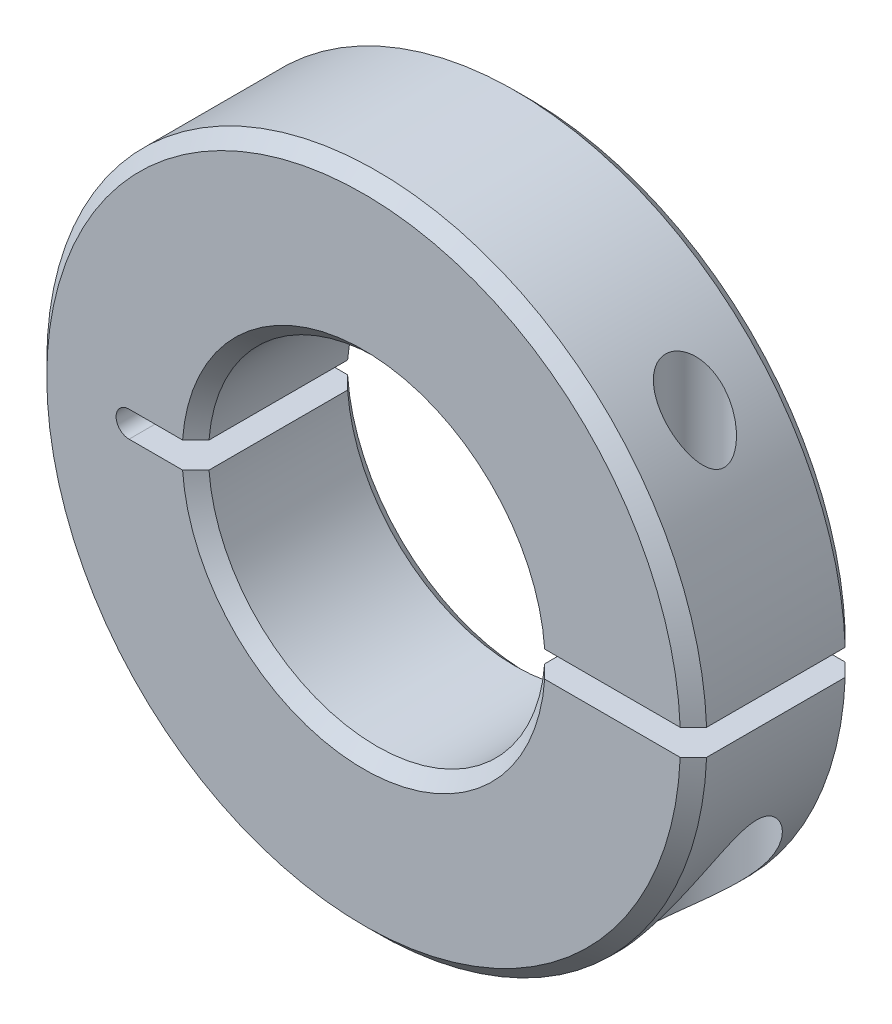
ISO-10303-21;
HEADER;
FILE_DESCRIPTION(('STEP AP214'),'2;1');
FILE_NAME('part.step','',(''),(''),'','','');
FILE_SCHEMA(('AUTOMOTIVE_DESIGN { 1 0 10303 214 1 1 1 1 }'));
ENDSEC;
DATA;
#1=APPLICATION_CONTEXT('core data for automotive mechanical design processes');
#2=APPLICATION_PROTOCOL_DEFINITION('international standard','automotive_design',2000,#1);
#3=PRODUCT_CONTEXT('',#1,'mechanical');
#4=PRODUCT('Part','Part','',(#3));
#5=PRODUCT_RELATED_PRODUCT_CATEGORY('part','',(#4));
#6=PRODUCT_DEFINITION_FORMATION('','',#4);
#7=PRODUCT_DEFINITION_CONTEXT('part definition',#1,'design');
#8=PRODUCT_DEFINITION('design','',#6,#7);
#9=PRODUCT_DEFINITION_SHAPE('','',#8);
#10=(LENGTH_UNIT() NAMED_UNIT(*) SI_UNIT(.MILLI.,.METRE.));
#11=(NAMED_UNIT(*) PLANE_ANGLE_UNIT() SI_UNIT($,.RADIAN.));
#12=(NAMED_UNIT(*) SI_UNIT($,.STERADIAN.) SOLID_ANGLE_UNIT());
#13=UNCERTAINTY_MEASURE_WITH_UNIT(LENGTH_MEASURE(1.E-05),#10,'distance_accuracy_value','');
#14=(GEOMETRIC_REPRESENTATION_CONTEXT(3) GLOBAL_UNCERTAINTY_ASSIGNED_CONTEXT((#13)) GLOBAL_UNIT_ASSIGNED_CONTEXT((#10,
#11,#12)) REPRESENTATION_CONTEXT('',''));
#15=CARTESIAN_POINT('',(0.,0.,0.));
#16=DIRECTION('',(0.,0.,1.));
#17=DIRECTION('',(1.,0.,0.));
#18=AXIS2_PLACEMENT_3D('',#15,#16,#17);
#19=CARTESIAN_POINT('',(-13.5403707337033,2.61561229831386,-2.57291950947665));
#20=DIRECTION('',(0.,0.,-1.));
#21=DIRECTION('',(-1.,0.,0.));
#22=AXIS2_PLACEMENT_3D('',#19,#20,#21);
#23=CYLINDRICAL_SURFACE('',#22,0.5);
#24=CARTESIAN_POINT('',(-13.5403707337033,2.61561229831386,-2.57291950947665));
#25=DIRECTION('',(0.,0.,-1.));
#26=DIRECTION('',(-1.,0.,0.));
#27=AXIS2_PLACEMENT_3D('',#24,#25,#26);
#28=CIRCLE('',#27,0.5);
#29=CARTESIAN_POINT('',(-13.5403707337033,3.11561229831386,-2.57291950947665));
#30=VERTEX_POINT('',#29);
#31=CARTESIAN_POINT('',(-13.5403707337033,2.11561229831386,-2.57291950947665));
#32=VERTEX_POINT('',#31);
#33=EDGE_CURVE('E128',#30,#32,#28,.F.);
#34=ORIENTED_EDGE('',*,*,#33,.F.);
#35=DIRECTION('',(0.,0.,1.));
#36=VECTOR('',#35,1.);
#37=CARTESIAN_POINT('',(-13.5403707337033,3.11561229831386,3.77708049052335));
#38=LINE('',#37,#36);
#39=CARTESIAN_POINT('',(-13.5403707337033,3.11561229831386,3.77708049052335));
#40=VERTEX_POINT('',#39);
#41=EDGE_CURVE('E130',#30,#40,#38,.T.);
#42=ORIENTED_EDGE('',*,*,#41,.T.);
#43=CARTESIAN_POINT('',(-13.5403707337033,2.61561229831386,3.77708049052335));
#44=DIRECTION('',(0.,0.,-1.));
#45=DIRECTION('',(-1.,0.,0.));
#46=AXIS2_PLACEMENT_3D('',#43,#44,#45);
#47=CIRCLE('',#46,0.5);
#48=CARTESIAN_POINT('',(-13.5403707337033,2.11561229831386,3.77708049052335));
#49=VERTEX_POINT('',#48);
#50=EDGE_CURVE('E20',#49,#40,#47,.T.);
#51=ORIENTED_EDGE('',*,*,#50,.F.);
#52=DIRECTION('',(0.,0.,-1.));
#53=VECTOR('',#52,1.);
#54=CARTESIAN_POINT('',(-13.5403707337033,2.11561229831386,3.77708049052335));
#55=LINE('',#54,#53);
#56=EDGE_CURVE('E161',#49,#32,#55,.T.);
#57=ORIENTED_EDGE('',*,*,#56,.T.);
#58=EDGE_LOOP('',(#34,#42,#51,#57));
#59=FACE_BOUND('',#58,.T.);
#60=ADVANCED_FACE('F17',(#59),#23,.F.);
#61=CARTESIAN_POINT('',(-4.51537073370329,2.61561229831386,3.77708049040848));
#62=DIRECTION('',(0.,0.,1.));
#63=DIRECTION('',(0.,-1.,0.));
#64=AXIS2_PLACEMENT_3D('',#61,#62,#63);
#65=CONICAL_SURFACE('',#64,6.98499999997577,0.785398163397448);
#66=CARTESIAN_POINT('',(-4.51537073370329,2.61561229831386,3.77708049052217));
#67=DIRECTION('',(0.,0.,1.));
#68=DIRECTION('',(0.,-1.,0.));
#69=AXIS2_PLACEMENT_3D('',#66,#67,#68);
#70=CIRCLE('',#69,6.98500000008945);
#71=CARTESIAN_POINT('',(2.4517107931001,2.11561229831386,3.77708049051325));
#72=VERTEX_POINT('',#71);
#73=CARTESIAN_POINT('',(-11.4824522604978,2.11561229831386,3.77708049050444));
#74=VERTEX_POINT('',#73);
#75=EDGE_CURVE('E143',#72,#74,#70,.F.);
#76=ORIENTED_EDGE('',*,*,#75,.F.);
#77=CARTESIAN_POINT('',(1.94230137009464,2.11561229832615,3.26908049046226));
#78=CARTESIAN_POINT('',(2.02721181716358,2.11561229832,3.35373825595638));
#79=CARTESIAN_POINT('',(2.11211782595216,2.11561229831591,3.43840047204468));
#80=CARTESIAN_POINT('',(2.281920966951,2.11561229831181,3.60773380539203));
#81=CARTESIAN_POINT('',(2.36681809916126,2.11561229831181,3.6924049226511));
#82=CARTESIAN_POINT('',(2.45171079309116,2.11561229831386,3.77708049050433));
#83=B_SPLINE_CURVE_WITH_KNOTS('',3,(#77,#78,#79,#80,#81,#82),.UNSPECIFIED.,.F.,.F.,(4,2,4),(0.,
0.359708896821428,0.719417793568256),.UNSPECIFIED.);
#84=CARTESIAN_POINT('',(1.94230137009217,2.11561229831386,3.26908049048868));
#85=VERTEX_POINT('',#84);
#86=EDGE_CURVE('E330',#85,#72,#83,.T.);
#87=ORIENTED_EDGE('',*,*,#86,.F.);
#88=CARTESIAN_POINT('',(-4.51537073370329,2.61561229831386,3.26908049052333));
#89=DIRECTION('',(0.,0.,1.));
#90=DIRECTION('',(1.,0.,0.));
#91=AXIS2_PLACEMENT_3D('',#88,#89,#90);
#92=CIRCLE('',#91,6.477);
#93=CARTESIAN_POINT('',(-10.9730428375081,2.11561229831386,3.26908049049802));
#94=VERTEX_POINT('',#93);
#95=EDGE_CURVE('E177',#85,#94,#92,.F.);
#96=ORIENTED_EDGE('',*,*,#95,.T.);
#97=CARTESIAN_POINT('',(-10.9730428375282,2.11561229831386,3.26908049047271));
#98=CARTESIAN_POINT('',(-11.0579532845869,2.11561229831386,3.3537382559649));
#99=CARTESIAN_POINT('',(-11.1428592933667,2.11561229831386,3.43840047204989));
#100=CARTESIAN_POINT('',(-11.3126624343507,2.11561229831386,3.60773380538789));
#101=CARTESIAN_POINT('',(-11.3975595665549,2.11561229831386,3.6924049226409));
#102=CARTESIAN_POINT('',(-11.4824522604801,2.11561229831386,3.7770804904867));
#103=B_SPLINE_CURVE_WITH_KNOTS('',3,(#97,#98,#99,#100,#101,#102),.UNSPECIFIED.,.F.,.F.,(4,2,4),
(0.,0.359708896795713,0.719417793516825),.UNSPECIFIED.);
#104=EDGE_CURVE('E134',#94,#74,#103,.T.);
#105=ORIENTED_EDGE('',*,*,#104,.T.);
#106=EDGE_LOOP('',(#76,#87,#96,#105));
#107=FACE_BOUND('',#106,.T.);
#108=ADVANCED_FACE('F318',(#107),#65,.F.);
#109=CARTESIAN_POINT('',(-4.51537073370329,2.61561229831386,3.77708049040848));
#110=DIRECTION('',(0.,0.,1.));
#111=DIRECTION('',(0.,-1.,0.));
#112=AXIS2_PLACEMENT_3D('',#109,#110,#111);
#113=CONICAL_SURFACE('',#112,6.98499999997577,0.785398163397448);
#114=CARTESIAN_POINT('',(-4.51537073370329,2.61561229831386,3.77708049052217));
#115=DIRECTION('',(0.,0.,1.));
#116=DIRECTION('',(0.,-1.,0.));
#117=AXIS2_PLACEMENT_3D('',#114,#115,#116);
#118=CIRCLE('',#117,6.98500000008945);
#119=CARTESIAN_POINT('',(-11.4824522604978,3.11561229831386,3.77708049050444));
#120=VERTEX_POINT('',#119);
#121=CARTESIAN_POINT('',(2.4517107931001,3.11561229831386,3.77708049051325));
#122=VERTEX_POINT('',#121);
#123=EDGE_CURVE('E139',#120,#122,#118,.F.);
#124=ORIENTED_EDGE('',*,*,#123,.F.);
#125=CARTESIAN_POINT('',(-11.4824522604801,3.11561229831386,3.7770804904867));
#126=CARTESIAN_POINT('',(-11.3975595665553,3.11561229831386,3.69240492264133));
#127=CARTESIAN_POINT('',(-11.3126624343515,3.11561229831386,3.60773380538875));
#128=CARTESIAN_POINT('',(-11.1428592933684,3.11561229831386,3.43840047205161));
#129=CARTESIAN_POINT('',(-11.0579532845891,3.11561229831386,3.35373825596705));
#130=CARTESIAN_POINT('',(-10.9730428375308,3.11561229831386,3.26908049047529));
#131=B_SPLINE_CURVE_WITH_KNOTS('',3,(#125,#126,#127,#128,#129,#130),.UNSPECIFIED.,.F.,.F.,(4,2,
4),(0.,0.359708896719285,0.71941779351317),.UNSPECIFIED.);
#132=CARTESIAN_POINT('',(-10.9730428375094,3.11561229831386,3.26908049049931));
#133=VERTEX_POINT('',#132);
#134=EDGE_CURVE('E133',#120,#133,#131,.T.);
#135=ORIENTED_EDGE('',*,*,#134,.T.);
#136=CARTESIAN_POINT('',(-4.51537073370329,2.61561229831386,3.26908049052333));
#137=DIRECTION('',(0.,0.,1.));
#138=DIRECTION('',(1.,0.,0.));
#139=AXIS2_PLACEMENT_3D('',#136,#137,#138);
#140=CIRCLE('',#139,6.477);
#141=CARTESIAN_POINT('',(1.94230137009217,3.11561229831386,3.26908049048868));
#142=VERTEX_POINT('',#141);
#143=EDGE_CURVE('E173',#133,#142,#140,.F.);
#144=ORIENTED_EDGE('',*,*,#143,.T.);
#145=CARTESIAN_POINT('',(2.4517107930834,3.11561229830229,3.77708049051212));
#146=CARTESIAN_POINT('',(2.36681809915601,3.11561229830808,3.69240492265637));
#147=CARTESIAN_POINT('',(2.28192096694834,3.11561229831193,3.60773380539471));
#148=CARTESIAN_POINT('',(2.11211782595483,3.11561229831579,3.43840047204201));
#149=CARTESIAN_POINT('',(2.02721181716898,3.11561229831579,3.35373825595097));
#150=CARTESIAN_POINT('',(1.94230137010285,3.11561229831386,3.26908049045402));
#151=B_SPLINE_CURVE_WITH_KNOTS('',3,(#145,#146,#147,#148,#149,#150),.UNSPECIFIED.,.F.,.F.,(4,2,
4),(0.,0.359708896746828,0.719417793568255),.UNSPECIFIED.);
#152=EDGE_CURVE('E324',#122,#142,#151,.T.);
#153=ORIENTED_EDGE('',*,*,#152,.F.);
#154=EDGE_LOOP('',(#124,#135,#144,#153));
#155=FACE_BOUND('',#154,.T.);
#156=ADVANCED_FACE('F314',(#155),#113,.F.);
#157=CARTESIAN_POINT('',(-4.51537073370329,2.61561229831386,-2.57291950947547));
#158=DIRECTION('',(0.,0.,-1.));
#159=DIRECTION('',(-1.,0.,0.));
#160=AXIS2_PLACEMENT_3D('',#157,#158,#159);
#161=CONICAL_SURFACE('',#160,6.98499999999629,0.785398163453397);
#162=CARTESIAN_POINT('',(-4.51537073370329,2.61561229831386,-2.06491950947665));
#163=DIRECTION('',(0.,0.,1.));
#164=DIRECTION('',(1.,0.,0.));
#165=AXIS2_PLACEMENT_3D('',#162,#163,#164);
#166=CIRCLE('',#165,6.477);
#167=CARTESIAN_POINT('',(-10.9730428374742,2.11561229831386,-2.06491950949249));
#168=VERTEX_POINT('',#167);
#169=CARTESIAN_POINT('',(1.94230137006789,2.11561229831386,-2.06491950949279));
#170=VERTEX_POINT('',#169);
#171=EDGE_CURVE('E176',#168,#170,#166,.T.);
#172=ORIENTED_EDGE('',*,*,#171,.T.);
#173=CARTESIAN_POINT('',(2.45171079301663,2.11561229831386,-2.57291950947645));
#174=CARTESIAN_POINT('',(2.36681809908969,2.11561229831386,-2.48824394163839));
#175=CARTESIAN_POINT('',(2.28192096688376,2.11561229831386,-2.40357282439312));
#176=CARTESIAN_POINT('',(2.11211782589632,2.11561229831386,-2.23423949107061));
#177=CARTESIAN_POINT('',(2.0272118171148,2.11561229831386,-2.14957727499337));
#178=CARTESIAN_POINT('',(1.9423013700543,2.11561229831386,-2.06491950950892));
#179=B_SPLINE_CURVE_WITH_KNOTS('',3,(#173,#174,#175,#176,#177,#178),.UNSPECIFIED.,.F.,.F.,(4,2,
4),(0.,0.359708896708405,0.71941779349141),.UNSPECIFIED.);
#180=CARTESIAN_POINT('',(2.45171079301614,2.11561229831386,-2.57291950947596));
#181=VERTEX_POINT('',#180);
#182=EDGE_CURVE('E164',#181,#170,#179,.T.);
#183=ORIENTED_EDGE('',*,*,#182,.F.);
#184=CARTESIAN_POINT('',(-4.51537073370329,2.61561229831386,-2.57291950947547));
#185=DIRECTION('',(0.,0.,-1.));
#186=DIRECTION('',(-1.,0.,0.));
#187=AXIS2_PLACEMENT_3D('',#184,#185,#186);
#188=CIRCLE('',#187,6.98499999999629);
#189=CARTESIAN_POINT('',(-11.4824522604232,2.11561229831386,-2.57291950947644));
#190=VERTEX_POINT('',#189);
#191=EDGE_CURVE('E141',#181,#190,#188,.T.);
#192=ORIENTED_EDGE('',*,*,#191,.T.);
#193=CARTESIAN_POINT('',(-11.4824522604242,2.11561229831386,-2.57291950947741));
#194=CARTESIAN_POINT('',(-11.397559566497,2.11561229831386,-2.48824394163909));
#195=CARTESIAN_POINT('',(-11.3126624342908,2.11561229831386,-2.40357282439357));
#196=CARTESIAN_POINT('',(-11.1428592933028,2.11561229831386,-2.23423949107054));
#197=CARTESIAN_POINT('',(-11.0579532845211,2.11561229831386,-2.14957727499304));
#198=CARTESIAN_POINT('',(-10.9730428374603,2.11561229831386,-2.06491950950833));
#199=B_SPLINE_CURVE_WITH_KNOTS('',3,(#193,#194,#195,#196,#197,#198),.UNSPECIFIED.,.F.,.F.,(4,2,
4),(0.,0.359708896709502,0.719417793493605),.UNSPECIFIED.);
#200=EDGE_CURVE('E163',#190,#168,#199,.T.);
#201=ORIENTED_EDGE('',*,*,#200,.T.);
#202=EDGE_LOOP('',(#172,#183,#192,#201));
#203=FACE_BOUND('',#202,.T.);
#204=ADVANCED_FACE('F317',(#203),#161,.F.);
#205=CARTESIAN_POINT('',(-14.0403707337033,2.11561229831386,3.77708049052335));
#206=DIRECTION('',(0.,-1.,0.));
#207=DIRECTION('',(0.,0.,-1.));
#208=AXIS2_PLACEMENT_3D('',#205,#206,#207);
#209=PLANE('',#208);
#210=ORIENTED_EDGE('',*,*,#104,.F.);
#211=DIRECTION('',(0.,0.,1.));
#212=VECTOR('',#211,1.);
#213=CARTESIAN_POINT('',(-10.9730428374881,2.11561229831386,3.77708049052335));
#214=LINE('',#213,#212);
#215=EDGE_CURVE('E179',#94,#168,#214,.F.);
#216=ORIENTED_EDGE('',*,*,#215,.T.);
#217=ORIENTED_EDGE('',*,*,#200,.F.);
#218=DIRECTION('',(1.,0.,0.));
#219=VECTOR('',#218,1.);
#220=CARTESIAN_POINT('',(-4.51537073370329,2.11561229831386,-2.57291950947665));
#221=LINE('',#220,#219);
#222=EDGE_CURVE('E276',#190,#32,#221,.F.);
#223=ORIENTED_EDGE('',*,*,#222,.T.);
#224=ORIENTED_EDGE('',*,*,#56,.F.);
#225=DIRECTION('',(1.,0.,0.));
#226=VECTOR('',#225,1.);
#227=CARTESIAN_POINT('',(-4.51537073370329,2.11561229831386,3.77708049052335));
#228=LINE('',#227,#226);
#229=EDGE_CURVE('E127',#74,#49,#228,.F.);
#230=ORIENTED_EDGE('',*,*,#229,.F.);
#231=EDGE_LOOP('',(#210,#216,#217,#223,#224,#230));
#232=FACE_BOUND('',#231,.T.);
#233=ADVANCED_FACE('F301',(#232),#209,.F.);
#234=CARTESIAN_POINT('',(-14.0403707337033,3.11561229831386,3.77708049052335));
#235=DIRECTION('',(0.,1.,0.));
#236=DIRECTION('',(0.,0.,1.));
#237=AXIS2_PLACEMENT_3D('',#234,#235,#236);
#238=PLANE('',#237);
#239=ORIENTED_EDGE('',*,*,#134,.F.);
#240=DIRECTION('',(1.,0.,0.));
#241=VECTOR('',#240,1.);
#242=CARTESIAN_POINT('',(-4.51537073370329,3.11561229831386,3.77708049052335));
#243=LINE('',#242,#241);
#244=EDGE_CURVE('E124',#40,#120,#243,.T.);
#245=ORIENTED_EDGE('',*,*,#244,.F.);
#246=ORIENTED_EDGE('',*,*,#41,.F.);
#247=DIRECTION('',(1.,0.,0.));
#248=VECTOR('',#247,1.);
#249=CARTESIAN_POINT('',(-4.51537073370329,3.11561229831386,-2.57291950947665));
#250=LINE('',#249,#248);
#251=CARTESIAN_POINT('',(-11.4824522604228,3.11561229831386,-2.57291950947606));
#252=VERTEX_POINT('',#251);
#253=EDGE_CURVE('E275',#30,#252,#250,.T.);
#254=ORIENTED_EDGE('',*,*,#253,.T.);
#255=CARTESIAN_POINT('',(-11.4824522604232,3.11561229831386,-2.57291950947645));
#256=CARTESIAN_POINT('',(-11.3975595664963,3.11561229831386,-2.48824394163839));
#257=CARTESIAN_POINT('',(-11.3126624342903,3.11561229831386,-2.40357282439312));
#258=CARTESIAN_POINT('',(-11.1428592933029,3.11561229831386,-2.23423949107061));
#259=CARTESIAN_POINT('',(-11.0579532845214,3.11561229831386,-2.14957727499337));
#260=CARTESIAN_POINT('',(-10.9730428374609,3.11561229831386,-2.06491950950892));
#261=B_SPLINE_CURVE_WITH_KNOTS('',3,(#255,#256,#257,#258,#259,#260),.UNSPECIFIED.,.F.,.F.,(4,2,
4),(0.,0.359708896708398,0.719417793491398),.UNSPECIFIED.);
#262=CARTESIAN_POINT('',(-10.9730428374745,3.11561229831386,-2.06491950949279));
#263=VERTEX_POINT('',#262);
#264=EDGE_CURVE('E284',#252,#263,#261,.T.);
#265=ORIENTED_EDGE('',*,*,#264,.T.);
#266=DIRECTION('',(0.,0.,1.));
#267=VECTOR('',#266,1.);
#268=CARTESIAN_POINT('',(-10.9730428374881,3.11561229831386,3.77708049052335));
#269=LINE('',#268,#267);
#270=EDGE_CURVE('E168',#263,#133,#269,.T.);
#271=ORIENTED_EDGE('',*,*,#270,.T.);
#272=EDGE_LOOP('',(#239,#245,#246,#254,#265,#271));
#273=FACE_BOUND('',#272,.T.);
#274=ADVANCED_FACE('F136',(#273),#238,.F.);
#275=CARTESIAN_POINT('',(-4.51537073370329,2.61561229831386,-2.57291950947547));
#276=DIRECTION('',(0.,0.,-1.));
#277=DIRECTION('',(-1.,0.,0.));
#278=AXIS2_PLACEMENT_3D('',#275,#276,#277);
#279=CONICAL_SURFACE('',#278,6.98499999999629,0.785398163453397);
#280=CARTESIAN_POINT('',(-4.51537073370329,2.61561229831386,-2.06491950947665));
#281=DIRECTION('',(0.,0.,1.));
#282=DIRECTION('',(1.,0.,0.));
#283=AXIS2_PLACEMENT_3D('',#280,#281,#282);
#284=CIRCLE('',#283,6.477);
#285=CARTESIAN_POINT('',(1.94230137006789,3.11561229831386,-2.06491950949279));
#286=VERTEX_POINT('',#285);
#287=EDGE_CURVE('E165',#286,#263,#284,.T.);
#288=ORIENTED_EDGE('',*,*,#287,.T.);
#289=ORIENTED_EDGE('',*,*,#264,.F.);
#290=CARTESIAN_POINT('',(-4.51537073370329,2.61561229831386,-2.57291950947547));
#291=DIRECTION('',(0.,0.,-1.));
#292=DIRECTION('',(-1.,0.,0.));
#293=AXIS2_PLACEMENT_3D('',#290,#291,#292);
#294=CIRCLE('',#293,6.98499999999629);
#295=CARTESIAN_POINT('',(2.45171079301614,3.11561229831386,-2.57291950947596));
#296=VERTEX_POINT('',#295);
#297=EDGE_CURVE('E272',#252,#296,#294,.T.);
#298=ORIENTED_EDGE('',*,*,#297,.T.);
#299=CARTESIAN_POINT('',(1.94230137006023,3.11561229832273,-2.06491950950297));
#300=CARTESIAN_POINT('',(2.02721181711777,3.1156122983183,-2.14957727499039));
#301=CARTESIAN_POINT('',(2.11211782589731,3.11561229831534,-2.23423949106962));
#302=CARTESIAN_POINT('',(2.28192096688277,3.11561229831238,-2.40357282439412));
#303=CARTESIAN_POINT('',(2.3668180990887,3.11561229831238,-2.48824394163938));
#304=CARTESIAN_POINT('',(2.45171079301663,3.11561229831386,-2.57291950947645));
#305=B_SPLINE_CURVE_WITH_KNOTS('',3,(#299,#300,#301,#302,#303,#304),.UNSPECIFIED.,.F.,.F.,(4,2,
4),(0.,0.359708896783005,0.719417793491409),.UNSPECIFIED.);
#306=EDGE_CURVE('E169',#286,#296,#305,.T.);
#307=ORIENTED_EDGE('',*,*,#306,.F.);
#308=EDGE_LOOP('',(#288,#289,#298,#307));
#309=FACE_BOUND('',#308,.T.);
#310=ADVANCED_FACE('F290',(#309),#279,.F.);
#311=CARTESIAN_POINT('',(-4.51537073370329,2.61561229831386,3.77708049052335));
#312=DIRECTION('',(0.,0.,1.));
#313=DIRECTION('',(1.,0.,0.));
#314=AXIS2_PLACEMENT_3D('',#311,#312,#313);
#315=CYLINDRICAL_SURFACE('',#314,6.477);
#316=ORIENTED_EDGE('',*,*,#143,.F.);
#317=ORIENTED_EDGE('',*,*,#270,.F.);
#318=ORIENTED_EDGE('',*,*,#287,.F.);
#319=DIRECTION('',(0.,0.,-1.));
#320=VECTOR('',#319,1.);
#321=CARTESIAN_POINT('',(1.94230137008148,3.11561229831386,-2.57291950947665));
#322=LINE('',#321,#320);
#323=EDGE_CURVE('E152',#142,#286,#322,.T.);
#324=ORIENTED_EDGE('',*,*,#323,.F.);
#325=EDGE_LOOP('',(#316,#317,#318,#324));
#326=FACE_BOUND('',#325,.T.);
#327=ADVANCED_FACE('F294',(#326),#315,.F.);
#328=CARTESIAN_POINT('',(-4.51537073370329,2.61561229831386,3.77708049052335));
#329=DIRECTION('',(0.,0.,1.));
#330=DIRECTION('',(1.,0.,0.));
#331=AXIS2_PLACEMENT_3D('',#328,#329,#330);
#332=CYLINDRICAL_SURFACE('',#331,6.477);
#333=ORIENTED_EDGE('',*,*,#95,.F.);
#334=DIRECTION('',(0.,0.,1.));
#335=VECTOR('',#334,1.);
#336=CARTESIAN_POINT('',(1.94230137008148,2.11561229831386,-2.57291950947665));
#337=LINE('',#336,#335);
#338=EDGE_CURVE('E184',#170,#85,#337,.T.);
#339=ORIENTED_EDGE('',*,*,#338,.F.);
#340=ORIENTED_EDGE('',*,*,#171,.F.);
#341=ORIENTED_EDGE('',*,*,#215,.F.);
#342=EDGE_LOOP('',(#333,#339,#340,#341));
#343=FACE_BOUND('',#342,.T.);
#344=ADVANCED_FACE('F409',(#343),#332,.F.);
#345=CARTESIAN_POINT('',(-4.51537073370329,2.61561229831386,3.77708049052335));
#346=DIRECTION('',(0.,0.,1.));
#347=DIRECTION('',(1.,0.,0.));
#348=AXIS2_PLACEMENT_3D('',#345,#346,#347);
#349=PLANE('',#348);
#350=DIRECTION('',(1.,0.,0.));
#351=VECTOR('',#350,1.);
#352=CARTESIAN_POINT('',(8.18462926629671,3.11561229831386,3.77708049052335));
#353=LINE('',#352,#351);
#354=CARTESIAN_POINT('',(7.66637232712343,3.11561229831386,3.77708049052335));
#355=VERTEX_POINT('',#354);
#356=EDGE_CURVE('E157',#355,#122,#353,.F.);
#357=ORIENTED_EDGE('',*,*,#356,.F.);
#358=CARTESIAN_POINT('',(-4.51537073370329,2.61561229831386,3.77708049052335));
#359=DIRECTION('',(0.,0.,-1.));
#360=DIRECTION('',(-1.,0.,0.));
#361=AXIS2_PLACEMENT_3D('',#358,#359,#360);
#362=CIRCLE('',#361,12.192);
#363=CARTESIAN_POINT('',(7.66637232712343,2.11561229831386,3.77708049052335));
#364=VERTEX_POINT('',#363);
#365=EDGE_CURVE('E264',#364,#355,#362,.T.);
#366=ORIENTED_EDGE('',*,*,#365,.F.);
#367=DIRECTION('',(1.,0.,0.));
#368=VECTOR('',#367,1.);
#369=CARTESIAN_POINT('',(8.18462926629671,2.11561229831386,3.77708049052335));
#370=LINE('',#369,#368);
#371=EDGE_CURVE('E186',#72,#364,#370,.T.);
#372=ORIENTED_EDGE('',*,*,#371,.F.);
#373=ORIENTED_EDGE('',*,*,#75,.T.);
#374=ORIENTED_EDGE('',*,*,#229,.T.);
#375=ORIENTED_EDGE('',*,*,#50,.T.);
#376=ORIENTED_EDGE('',*,*,#244,.T.);
#377=ORIENTED_EDGE('',*,*,#123,.T.);
#378=EDGE_LOOP('',(#357,#366,#372,#373,#374,#375,#376,#377));
#379=FACE_BOUND('',#378,.T.);
#380=ADVANCED_FACE('F121',(#379),#349,.T.);
#381=CARTESIAN_POINT('',(-4.51537073370329,2.61561229831386,-2.57291950947665));
#382=DIRECTION('',(0.,0.,1.));
#383=DIRECTION('',(1.,0.,0.));
#384=AXIS2_PLACEMENT_3D('',#381,#382,#383);
#385=PLANE('',#384);
#386=CARTESIAN_POINT('',(-4.51537073370329,2.61561229831386,-2.57291950947535));
#387=DIRECTION('',(0.,0.,1.));
#388=DIRECTION('',(0.,-1.,0.));
#389=AXIS2_PLACEMENT_3D('',#386,#387,#388);
#390=CIRCLE('',#389,12.1919999999987);
#391=CARTESIAN_POINT('',(7.6663723271215,3.11561229831386,-2.572919509476));
#392=VERTEX_POINT('',#391);
#393=CARTESIAN_POINT('',(7.6663723271215,2.11561229831386,-2.572919509476));
#394=VERTEX_POINT('',#393);
#395=EDGE_CURVE('E187',#392,#394,#390,.T.);
#396=ORIENTED_EDGE('',*,*,#395,.F.);
#397=DIRECTION('',(1.,0.,0.));
#398=VECTOR('',#397,1.);
#399=CARTESIAN_POINT('',(8.18462926629671,3.11561229831386,-2.57291950947665));
#400=LINE('',#399,#398);
#401=EDGE_CURVE('E149',#296,#392,#400,.T.);
#402=ORIENTED_EDGE('',*,*,#401,.F.);
#403=ORIENTED_EDGE('',*,*,#297,.F.);
#404=ORIENTED_EDGE('',*,*,#253,.F.);
#405=ORIENTED_EDGE('',*,*,#33,.T.);
#406=ORIENTED_EDGE('',*,*,#222,.F.);
#407=ORIENTED_EDGE('',*,*,#191,.F.);
#408=DIRECTION('',(1.,0.,0.));
#409=VECTOR('',#408,1.);
#410=CARTESIAN_POINT('',(8.18462926629671,2.11561229831386,-2.57291950947665));
#411=LINE('',#410,#409);
#412=EDGE_CURVE('E231',#394,#181,#411,.F.);
#413=ORIENTED_EDGE('',*,*,#412,.F.);
#414=EDGE_LOOP('',(#396,#402,#403,#404,#405,#406,#407,#413));
#415=FACE_BOUND('',#414,.T.);
#416=ADVANCED_FACE('F340',(#415),#385,.F.);
#417=CARTESIAN_POINT('',(5.05854214987522,2.11561229831386,0.602080490523349));
#418=DIRECTION('',(0.,-1.,0.));
#419=DIRECTION('',(0.,0.,-1.));
#420=AXIS2_PLACEMENT_3D('',#417,#418,#419);
#421=CYLINDRICAL_SURFACE('',#420,1.63195);
#422=CARTESIAN_POINT('',(5.05854214987522,0.083612298567863,0.602080490523349));
#423=DIRECTION('',(0.,-1.,0.));
#424=DIRECTION('',(0.,0.,-1.));
#425=AXIS2_PLACEMENT_3D('',#422,#423,#424);
#426=CIRCLE('',#425,1.63195);
#427=CARTESIAN_POINT('',(5.05854214987522,0.083612298567863,-1.02986950947665));
#428=VERTEX_POINT('',#427);
#429=EDGE_CURVE('E269',#428,#428,#426,.T.);
#430=ORIENTED_EDGE('',*,*,#429,.T.);
#431=EDGE_LOOP('',(#430));
#432=FACE_BOUND('',#431,.T.);
#433=CARTESIAN_POINT('',(5.05854214987522,2.11561229856787,0.602080490523349));
#434=DIRECTION('',(0.,-1.,0.));
#435=DIRECTION('',(0.,0.,-1.));
#436=AXIS2_PLACEMENT_3D('',#433,#434,#435);
#437=CIRCLE('',#436,1.63195);
#438=CARTESIAN_POINT('',(5.05854214987522,2.11561229856787,-1.02986950947665));
#439=VERTEX_POINT('',#438);
#440=EDGE_CURVE('E350',#439,#439,#437,.T.);
#441=ORIENTED_EDGE('',*,*,#440,.F.);
#442=EDGE_LOOP('',(#441));
#443=FACE_BOUND('',#442,.T.);
#444=ADVANCED_FACE('F390',(#432,#443),#421,.F.);
#445=CARTESIAN_POINT('',(5.05854214987522,0.083612298313863,0.602080490523349));
#446=DIRECTION('',(0.,1.,0.));
#447=DIRECTION('',(0.,0.,1.));
#448=AXIS2_PLACEMENT_3D('',#445,#446,#447);
#449=PLANE('',#448);
#450=ORIENTED_EDGE('',*,*,#429,.F.);
#451=EDGE_LOOP('',(#450));
#452=FACE_BOUND('',#451,.T.);
#453=CARTESIAN_POINT('',(5.05854214987522,0.0836122985678634,0.602080490523349));
#454=DIRECTION('',(0.,-1.,0.));
#455=DIRECTION('',(0.,0.,-1.));
#456=AXIS2_PLACEMENT_3D('',#453,#454,#455);
#457=CIRCLE('',#456,2.38125);
#458=CARTESIAN_POINT('',(5.05854214987522,0.0836122985678634,-1.77916950947665));
#459=VERTEX_POINT('',#458);
#460=EDGE_CURVE('E353',#459,#459,#457,.T.);
#461=ORIENTED_EDGE('',*,*,#460,.T.);
#462=EDGE_LOOP('',(#461));
#463=FACE_BOUND('',#462,.T.);
#464=ADVANCED_FACE('F253',(#452,#463),#449,.F.);
#465=CARTESIAN_POINT('',(-4.51537073370329,2.61561229831386,3.26908049052464));
#466=DIRECTION('',(0.,0.,-1.));
#467=DIRECTION('',(-1.,0.,0.));
#468=AXIS2_PLACEMENT_3D('',#465,#466,#467);
#469=CONICAL_SURFACE('',#468,12.7000000000013,0.7853981634);
#470=CARTESIAN_POINT('',(-4.51537073370329,2.61561229831386,3.26908049052334));
#471=DIRECTION('',(0.,0.,1.));
#472=DIRECTION('',(1.,0.,0.));
#473=AXIS2_PLACEMENT_3D('',#470,#471,#472);
#474=CIRCLE('',#473,12.7);
#475=CARTESIAN_POINT('',(8.17478292966956,2.11561229831386,3.26908049052403));
#476=VERTEX_POINT('',#475);
#477=CARTESIAN_POINT('',(8.17478292966956,3.11561229831386,3.26908049052403));
#478=VERTEX_POINT('',#477);
#479=EDGE_CURVE('E146',#476,#478,#474,.F.);
#480=ORIENTED_EDGE('',*,*,#479,.F.);
#481=CARTESIAN_POINT('',(7.66637232712343,2.11561229831386,3.77708049052335));
#482=CARTESIAN_POINT('',(7.75110882471927,2.11561229831386,3.69241522215735));
#483=CARTESIAN_POINT('',(7.83584462372948,2.11561229831386,3.60774925464107));
#484=CARTESIAN_POINT('',(8.00531482457839,2.11561229831386,3.4384159213082));
#485=CARTESIAN_POINT('',(8.0900492264171,2.11561229831386,3.3537485554916));
#486=CARTESIAN_POINT('',(8.17478292967018,2.11561229831386,3.26908049052472));
#487=B_SPLINE_CURVE_WITH_KNOTS('',3,(#481,#482,#483,#484,#485,#486),.UNSPECIFIED.,.F.,.F.,(4,2,
4),(0.,0.359355444099972,0.718710888198945),.UNSPECIFIED.);
#488=EDGE_CURVE('E225',#364,#476,#487,.T.);
#489=ORIENTED_EDGE('',*,*,#488,.F.);
#490=ORIENTED_EDGE('',*,*,#365,.T.);
#491=CARTESIAN_POINT('',(8.17478292967018,3.11561229831386,3.26908049052472));
#492=CARTESIAN_POINT('',(8.0900492264171,3.11561229831386,3.3537485554916));
#493=CARTESIAN_POINT('',(8.00531482457839,3.11561229831386,3.4384159213082));
#494=CARTESIAN_POINT('',(7.83584462372947,3.11561229831386,3.60774925464108));
#495=CARTESIAN_POINT('',(7.75110882471927,3.11561229831386,3.69241522215735));
#496=CARTESIAN_POINT('',(7.66637232712343,3.11561229831386,3.77708049052335));
#497=B_SPLINE_CURVE_WITH_KNOTS('',3,(#491,#492,#493,#494,#495,#496),.UNSPECIFIED.,.F.,.F.,(4,2,
4),(0.,0.359355444098973,0.718710888198945),.UNSPECIFIED.);
#498=EDGE_CURVE('E159',#478,#355,#497,.T.);
#499=ORIENTED_EDGE('',*,*,#498,.F.);
#500=EDGE_LOOP('',(#480,#489,#490,#499));
#501=FACE_BOUND('',#500,.T.);
#502=ADVANCED_FACE('F247',(#501),#469,.T.);
#503=CARTESIAN_POINT('',(8.18462926629671,3.11561229831386,-2.57291950947665));
#504=DIRECTION('',(0.,-1.,0.));
#505=DIRECTION('',(0.,0.,-1.));
#506=AXIS2_PLACEMENT_3D('',#503,#504,#505);
#507=PLANE('',#506);
#508=CARTESIAN_POINT('',(5.05854214987522,3.11561229856786,0.602080490523349));
#509=DIRECTION('',(0.,1.,0.));
#510=DIRECTION('',(0.,0.,1.));
#511=AXIS2_PLACEMENT_3D('',#508,#509,#510);
#512=CIRCLE('',#511,1.1303);
#513=CARTESIAN_POINT('',(5.05854214987522,3.11561229856786,1.73238049052335));
#514=VERTEX_POINT('',#513);
#515=EDGE_CURVE('E357',#514,#514,#512,.T.);
#516=ORIENTED_EDGE('',*,*,#515,.T.);
#517=EDGE_LOOP('',(#516));
#518=FACE_BOUND('',#517,.T.);
#519=ORIENTED_EDGE('',*,*,#401,.T.);
#520=CARTESIAN_POINT('',(8.17478292966896,3.11561229831386,-2.06491950947666));
#521=CARTESIAN_POINT('',(8.09004922641587,3.11561229831386,-2.14958757444355));
#522=CARTESIAN_POINT('',(8.00531482457715,3.11561229831386,-2.23425494026016));
#523=CARTESIAN_POINT('',(7.83584462372821,3.11561229831386,-2.40358827359306));
#524=CARTESIAN_POINT('',(7.75110882471799,3.11561229831386,-2.48825424110934));
#525=CARTESIAN_POINT('',(7.66637232712214,3.11561229831386,-2.57291950947535));
#526=B_SPLINE_CURVE_WITH_KNOTS('',3,(#520,#521,#522,#523,#524,#525),.UNSPECIFIED.,.F.,.F.,(4,2,
4),(0.,0.35935544409902,0.718710888199038),.UNSPECIFIED.);
#527=CARTESIAN_POINT('',(8.17478292966896,3.11561229831386,-2.06491950947666));
#528=VERTEX_POINT('',#527);
#529=EDGE_CURVE('E151',#528,#392,#526,.T.);
#530=ORIENTED_EDGE('',*,*,#529,.F.);
#531=DIRECTION('',(0.,0.,1.));
#532=VECTOR('',#531,1.);
#533=CARTESIAN_POINT('',(8.17478292966895,3.11561229831386,3.77708049052335));
#534=LINE('',#533,#532);
#535=EDGE_CURVE('E153',#478,#528,#534,.F.);
#536=ORIENTED_EDGE('',*,*,#535,.F.);
#537=ORIENTED_EDGE('',*,*,#498,.T.);
#538=ORIENTED_EDGE('',*,*,#356,.T.);
#539=ORIENTED_EDGE('',*,*,#152,.T.);
#540=ORIENTED_EDGE('',*,*,#323,.T.);
#541=ORIENTED_EDGE('',*,*,#306,.T.);
#542=EDGE_LOOP('',(#519,#530,#536,#537,#538,#539,#540,#541));
#543=FACE_BOUND('',#542,.T.);
#544=ADVANCED_FACE('F252',(#518,#543),#507,.T.);
#545=CARTESIAN_POINT('',(-4.51537073370329,2.61561229831386,-2.06491950947666));
#546=DIRECTION('',(0.,0.,1.));
#547=DIRECTION('',(0.,-1.,0.));
#548=AXIS2_PLACEMENT_3D('',#545,#546,#547);
#549=CONICAL_SURFACE('',#548,12.7,0.7853981634);
#550=CARTESIAN_POINT('',(8.17478292966896,2.11561229831386,-2.06491950947666));
#551=CARTESIAN_POINT('',(8.09004922641587,2.11561229831386,-2.14958757444355));
#552=CARTESIAN_POINT('',(8.00531482457715,2.11561229831386,-2.23425494026016));
#553=CARTESIAN_POINT('',(7.83584462372821,2.11561229831386,-2.40358827359306));
#554=CARTESIAN_POINT('',(7.75110882471799,2.11561229831386,-2.48825424110934));
#555=CARTESIAN_POINT('',(7.66637232712214,2.11561229831386,-2.57291950947535));
#556=B_SPLINE_CURVE_WITH_KNOTS('',3,(#550,#551,#552,#553,#554,#555),.UNSPECIFIED.,.F.,.F.,(4,2,
4),(0.,0.359355444099021,0.718710888199039),.UNSPECIFIED.);
#557=CARTESIAN_POINT('',(8.17478292966896,2.11561229831386,-2.06491950947666));
#558=VERTEX_POINT('',#557);
#559=EDGE_CURVE('E35',#558,#394,#556,.T.);
#560=ORIENTED_EDGE('',*,*,#559,.F.);
#561=CARTESIAN_POINT('',(-4.51537073370329,2.61561229831386,-2.06491950947666));
#562=DIRECTION('',(0.,0.,1.));
#563=DIRECTION('',(1.,0.,0.));
#564=AXIS2_PLACEMENT_3D('',#561,#562,#563);
#565=CIRCLE('',#564,12.7);
#566=EDGE_CURVE('E156',#528,#558,#565,.T.);
#567=ORIENTED_EDGE('',*,*,#566,.F.);
#568=ORIENTED_EDGE('',*,*,#529,.T.);
#569=ORIENTED_EDGE('',*,*,#395,.T.);
#570=EDGE_LOOP('',(#560,#567,#568,#569));
#571=FACE_BOUND('',#570,.T.);
#572=ADVANCED_FACE('F364',(#571),#549,.T.);
#573=CARTESIAN_POINT('',(8.18462926629671,2.11561229831386,-2.57291950947665));
#574=DIRECTION('',(0.,1.,0.));
#575=DIRECTION('',(0.,0.,1.));
#576=AXIS2_PLACEMENT_3D('',#573,#574,#575);
#577=PLANE('',#576);
#578=ORIENTED_EDGE('',*,*,#440,.T.);
#579=EDGE_LOOP('',(#578));
#580=FACE_BOUND('',#579,.T.);
#581=ORIENTED_EDGE('',*,*,#412,.T.);
#582=ORIENTED_EDGE('',*,*,#182,.T.);
#583=ORIENTED_EDGE('',*,*,#338,.T.);
#584=ORIENTED_EDGE('',*,*,#86,.T.);
#585=ORIENTED_EDGE('',*,*,#371,.T.);
#586=ORIENTED_EDGE('',*,*,#488,.T.);
#587=DIRECTION('',(0.,0.,1.));
#588=VECTOR('',#587,1.);
#589=CARTESIAN_POINT('',(8.17478292966895,2.11561229831386,3.77708049052335));
#590=LINE('',#589,#588);
#591=EDGE_CURVE('E218',#558,#476,#590,.T.);
#592=ORIENTED_EDGE('',*,*,#591,.F.);
#593=ORIENTED_EDGE('',*,*,#559,.T.);
#594=EDGE_LOOP('',(#581,#582,#583,#584,#585,#586,#592,#593));
#595=FACE_BOUND('',#594,.T.);
#596=ADVANCED_FACE('F245',(#580,#595),#577,.T.);
#597=CARTESIAN_POINT('',(5.05854214987522,-10.0843877016861,0.602080490523349));
#598=DIRECTION('',(0.,-1.,0.));
#599=DIRECTION('',(0.,0.,-1.));
#600=AXIS2_PLACEMENT_3D('',#597,#598,#599);
#601=CYLINDRICAL_SURFACE('',#600,2.38125);
#602=CARTESIAN_POINT('',(5.05854214987522,-5.72885845168877,2.98333049052335));
#603=CARTESIAN_POINT('',(5.16367296614203,-5.60824059387958,2.98332926045922));
#604=CARTESIAN_POINT('',(5.26648529143224,-5.4856664338235,2.97638273128386));
#605=CARTESIAN_POINT('',(5.46683857369045,-5.23747268409344,2.95024106640302));
#606=CARTESIAN_POINT('',(5.56437661840829,-5.11185146629961,2.93103923722347));
#607=CARTESIAN_POINT('',(5.75384258269321,-4.85823308520215,2.8816661162216));
#608=CARTESIAN_POINT('',(5.84576031840401,-4.73023212679225,2.85147556315464));
#609=CARTESIAN_POINT('',(6.02352997933369,-4.47283135103542,2.78113665868129));
#610=CARTESIAN_POINT('',(6.1093833167507,-4.3434318675051,2.74099063546251));
#611=CARTESIAN_POINT('',(6.2789330097723,-4.07759677896219,2.64921056468349));
#612=CARTESIAN_POINT('',(6.36232148811524,-3.94112499515538,2.59711283051437));
#613=CARTESIAN_POINT('',(6.52218077902668,-3.66829260642009,2.48297437047688));
#614=CARTESIAN_POINT('',(6.59865138930031,-3.53193200485832,2.4209333539903));
#615=CARTESIAN_POINT('',(6.74485836653025,-3.2598580908085,2.28630989782801));
#616=CARTESIAN_POINT('',(6.81456464788637,-3.12415001283078,2.21368366407508));
#617=CARTESIAN_POINT('',(6.91350540932713,-2.92301431895513,2.09609223743858));
#618=CARTESIAN_POINT('',(6.9455370022334,-2.85640083103818,2.05547186807729));
#619=CARTESIAN_POINT('',(7.007668086859,-2.72432170003209,1.97102565217366));
#620=CARTESIAN_POINT('',(7.03776795435265,-2.65885583551025,1.92720043263429));
#621=CARTESIAN_POINT('',(7.0979037471135,-2.52516434442902,1.83281176901525));
#622=CARTESIAN_POINT('',(7.12779637468641,-2.45705342520356,1.78199281708111));
#623=CARTESIAN_POINT('',(7.18500540809092,-2.32366427425516,1.6754681995046));
#624=CARTESIAN_POINT('',(7.21232358519612,-2.25838411185741,1.61976594536263));
#625=CARTESIAN_POINT('',(7.26374587115481,-2.13275278404367,1.50289832549572));
#626=CARTESIAN_POINT('',(7.28787826936567,-2.07236038215799,1.4417904224821));
#627=CARTESIAN_POINT('',(7.33244570183228,-1.95854781240823,1.31228627733294));
#628=CARTESIAN_POINT('',(7.35289265260749,-1.90510533468335,1.2439147044029));
#629=CARTESIAN_POINT('',(7.38274478609055,-1.82578512102074,1.12257710597151));
#630=CARTESIAN_POINT('',(7.39355538958689,-1.79666740442449,1.07211075276645));
#631=CARTESIAN_POINT('',(7.41225950374406,-1.74585183272473,0.967042279056437));
#632=CARTESIAN_POINT('',(7.42015877957128,-1.72413931987666,0.912448593050655));
#633=CARTESIAN_POINT('',(7.43100750336734,-1.69417323028214,0.811336324104872));
#634=CARTESIAN_POINT('',(7.43463863376669,-1.68407587696245,0.7654477839338));
#635=CARTESIAN_POINT('',(7.43920364518546,-1.67136802929135,0.672507525692214));
#636=CARTESIAN_POINT('',(7.44013957538504,-1.66875184696224,0.625456718768727));
#637=CARTESIAN_POINT('',(7.43921159153419,-1.67134027071458,0.531581682410515));
#638=CARTESIAN_POINT('',(7.43734620345165,-1.67654899420177,0.484757585277384));
#639=CARTESIAN_POINT('',(7.43101655278455,-1.69413418533027,0.39266298344445));
#640=CARTESIAN_POINT('',(7.42654965293502,-1.70651792653146,0.347394104724726));
#641=CARTESIAN_POINT('',(7.41306123682333,-1.74363526966217,0.240733236123058));
#642=CARTESIAN_POINT('',(7.40291513192213,-1.77137037637174,0.180544387485542));
#643=CARTESIAN_POINT('',(7.37927691190699,-1.83506295053664,0.065401520941872));
#644=CARTESIAN_POINT('',(7.36577486209954,-1.87104480597689,0.0104637287497554));
#645=CARTESIAN_POINT('',(7.33704057625016,-1.94639243882536,-0.0917929714513703));
#646=CARTESIAN_POINT('',(7.32193900667031,-1.98547542837967,-0.13936194359236));
#647=CARTESIAN_POINT('',(7.28990032343968,-2.06706932088559,-0.23082883754262));
#648=CARTESIAN_POINT('',(7.27296146203245,-2.10958347778323,-0.274723192237561));
#649=CARTESIAN_POINT('',(7.21976721569539,-2.24086915375008,-0.401888050359228));
#650=CARTESIAN_POINT('',(7.18118997226507,-2.33323533189819,-0.480454994788713));
#651=CARTESIAN_POINT('',(7.09291612052683,-2.53723992586761,-0.639331341667088));
#652=CARTESIAN_POINT('',(7.04241999071646,-2.64968400407276,-0.718116524455313));
#653=CARTESIAN_POINT('',(6.93556613713107,-2.87820170232719,-0.866063091164592));
#654=CARTESIAN_POINT('',(6.87920187097339,-2.99427927034702,-0.935213528139477));
#655=CARTESIAN_POINT('',(6.76088884880057,-3.22846348208861,-1.06528335273333));
#656=CARTESIAN_POINT('',(6.69893069951809,-3.34657325871175,-1.12618844954173));
#657=CARTESIAN_POINT('',(6.56966553412891,-3.58359754583105,-1.24027779679212));
#658=CARTESIAN_POINT('',(6.50235793567541,-3.70251214264819,-1.29346120485646));
#659=CARTESIAN_POINT('',(6.35364415172338,-3.95543546476643,-1.3985108965365));
#660=CARTESIAN_POINT('',(6.27153125428558,-4.08945230369533,-1.44936109448155));
#661=CARTESIAN_POINT('',(6.1007167166021,-4.35675133420594,-1.54119401364046));
#662=CARTESIAN_POINT('',(6.01201265830624,-4.49003323671223,-1.58217308988942));
#663=CARTESIAN_POINT('',(5.82857038129955,-4.75450859569128,-1.65336845221531));
#664=CARTESIAN_POINT('',(5.73385746245915,-4.88570823441732,-1.68362673735487));
#665=CARTESIAN_POINT('',(5.53841541189211,-5.14568846042559,-1.73248777331649));
#666=CARTESIAN_POINT('',(5.43769098827493,-5.27447083959254,-1.75109951763838));
#667=CARTESIAN_POINT('',(5.28928674535734,-5.45679535229129,-1.76839456104469));
#668=CARTESIAN_POINT('',(5.24383765420178,-5.51168310480855,-1.77239523145775));
#669=CARTESIAN_POINT('',(5.15193030990548,-5.62079393716919,-1.77778303365592));
#670=CARTESIAN_POINT('',(5.10547139487166,-5.67501654224599,-1.77916839556542));
#671=CARTESIAN_POINT('',(4.92670269638734,-5.88011781919442,-1.7791726388142));
#672=CARTESIAN_POINT('',(4.79115125715066,-6.02837262207431,-1.76825086595409));
#673=CARTESIAN_POINT('',(4.5151633808457,-6.31630598213954,-1.72056788826368));
#674=CARTESIAN_POINT('',(4.37472472375156,-6.45598055993517,-1.68379479087217));
#675=CARTESIAN_POINT('',(4.11579206141884,-6.70209722870778,-1.58823166135393));
#676=CARTESIAN_POINT('',(3.9973576771014,-6.81029296401224,-1.53386959358483));
#677=CARTESIAN_POINT('',(3.76431946808421,-7.015624864897,-1.40122824130125));
#678=CARTESIAN_POINT('',(3.64971041680109,-7.11277659692062,-1.32298320801121));
#679=CARTESIAN_POINT('',(3.44981648095941,-7.2767803050713,-1.15747379272344));
#680=CARTESIAN_POINT('',(3.36297248207693,-7.34593619655411,-1.07438635588654));
#681=CARTESIAN_POINT('',(3.1995056717307,-7.47306369065878,-0.891023836363841));
#682=CARTESIAN_POINT('',(3.12288082163142,-7.53103752504132,-0.790752190932872));
#683=CARTESIAN_POINT('',(3.0187235668644,-7.60834667669759,-0.628245927420498));
#684=CARTESIAN_POINT('',(2.98567536642252,-7.63259604083469,-0.571774817335977));
#685=CARTESIAN_POINT('',(2.9238669937135,-7.67755027980046,-0.455206753094906));
#686=CARTESIAN_POINT('',(2.89510458766043,-7.69825700191874,-0.395111710863169));
#687=CARTESIAN_POINT('',(2.8423980941477,-7.73592342400256,-0.271735352749195));
#688=CARTESIAN_POINT('',(2.81845244793551,-7.75288433632484,-0.208455075955979));
#689=CARTESIAN_POINT('',(2.77583720452255,-7.78289529843939,-0.0792736258007537));
#690=CARTESIAN_POINT('',(2.75716670737527,-7.79594601533849,-0.0133729016810542));
#691=CARTESIAN_POINT('',(2.71402908068856,-7.82598375918602,0.168934054258374));
#692=CARTESIAN_POINT('',(2.69513258813831,-7.83899334690477,0.287403340390849));
#693=CARTESIAN_POINT('',(2.67547266493333,-7.85252596644238,0.526446357102039));
#694=CARTESIAN_POINT('',(2.67469974932835,-7.85305552966642,0.647018953848457));
#695=CARTESIAN_POINT('',(2.69065246473448,-7.84207861189358,0.877341309667802));
#696=CARTESIAN_POINT('',(2.70607564397192,-7.83146800926317,0.987226884551311));
#697=CARTESIAN_POINT('',(2.75156938483526,-7.79987331448574,1.202343620625));
#698=CARTESIAN_POINT('',(2.7816388579338,-7.77888999324792,1.30757512707636));
#699=CARTESIAN_POINT('',(2.8553662467099,-7.72674173960027,1.51222786628557));
#700=CARTESIAN_POINT('',(2.89921073954561,-7.69543669688916,1.61154559220495));
#701=CARTESIAN_POINT('',(2.99818537326949,-7.62353842342054,1.800700047951));
#702=CARTESIAN_POINT('',(3.05331812112777,-7.58294304684809,1.89053458040168));
#703=CARTESIAN_POINT('',(3.17785531836752,-7.48937868370149,2.06702226164461));
#704=CARTESIAN_POINT('',(3.24809664322985,-7.43562606160948,2.15266587004278));
#705=CARTESIAN_POINT('',(3.39615374306563,-7.31951045197327,2.31045673887028));
#706=CARTESIAN_POINT('',(3.47397444083861,-7.25714185720821,2.38259513759824));
#707=CARTESIAN_POINT('',(3.67043732338455,-7.09546588655549,2.54268922356688));
#708=CARTESIAN_POINT('',(3.79176847713156,-6.99211454796702,2.623286174007));
#709=CARTESIAN_POINT('',(4.03815197670125,-6.77345216407755,2.75822899989453));
#710=CARTESIAN_POINT('',(4.16321041377123,-6.65812067904702,2.8125290853986));
#711=CARTESIAN_POINT('',(4.41941509556928,-6.41173111371428,2.90016783461977));
#712=CARTESIAN_POINT('',(4.55051056423347,-6.28015419806029,2.93216404834593));
#713=CARTESIAN_POINT('',(4.80831837647652,-6.00957152818053,2.97374714585339));
#714=CARTESIAN_POINT('',(4.93503030939558,-5.87056508102679,2.98333193565133));
#715=CARTESIAN_POINT('',(5.05854214987522,-5.72885845168877,2.98333049052335));
#716=B_SPLINE_CURVE_WITH_KNOTS('',3,(#602,#603,#604,#605,#606,#607,#608,#609,#610,#611,#612,
#613,#614,#615,#616,#617,#618,#619,#620,#621,#622,#623,#624,#625,#626,#627,#628,#629,#630,#631,
#632,#633,#634,#635,#636,#637,#638,#639,#640,#641,#642,#643,#644,#645,#646,#647,#648,#649,#650,
#651,#652,#653,#654,#655,#656,#657,#658,#659,#660,#661,#662,#663,#664,#665,#666,#667,#668,#669,
#670,#671,#672,#673,#674,#675,#676,#677,#678,#679,#680,#681,#682,#683,#684,#685,#686,#687,#688,
#689,#690,#691,#692,#693,#694,#695,#696,#697,#698,#699,#700,#701,#702,#703,#704,#705,#706,#707,
#708,#709,#710,#711,#712,#713,#714,#715),.UNSPECIFIED.,.T.,.F.,(4,2,2,2,2,2,2,2,2,2,2,2,2,2,2,2,
2,2,2,2,2,2,2,2,2,2,2,2,2,2,2,2,2,2,2,2,2,2,2,2,2,2,2,2,2,2,2,2,2,2,2,2,2,2,2,2,4),(0.,
0.479789284369339,0.959840839637228,1.44073792281241,1.9215226492133,2.4256856791397,
2.92986344722604,3.43618969288113,3.68914142572143,3.94204380232439,4.21212941225123,
4.48202782004814,4.7493400245591,5.0157717593557,5.19305823331158,5.36999172442909,
5.51076368022984,5.65142857780185,5.79216751809974,5.9330493805047,6.13303349019012,
6.33361682035665,6.5235033831679,6.71357218996304,7.09443499507271,7.53273745783284,
7.97153392581455,8.41108143602408,8.85067686156038,9.3458339313803,9.84117356129634,
10.334550648256,10.8275462760157,11.0416171802111,11.255832902215,11.857634267646,
12.459712665189,12.9661032675719,13.4717710263815,13.886169690226,14.3004855609149,
14.5095610550637,14.7185271935445,14.9274255992773,15.1362883451531,15.4961784781194,
15.8558802588502,16.1887201118849,16.5215352316987,16.8590680806413,17.1966789693338,
17.5645972271501,17.932756061835,18.4655965345302,18.9993615198546,19.5629842857136,
20.126659710857),.UNSPECIFIED.);
#717=CARTESIAN_POINT('',(5.05854214987522,-5.72885845168877,2.98333049052335));
#718=VERTEX_POINT('',#717);
#719=EDGE_CURVE('E26',#718,#718,#716,.T.);
#720=ORIENTED_EDGE('',*,*,#719,.F.);
#721=EDGE_LOOP('',(#720));
#722=FACE_BOUND('',#721,.T.);
#723=ORIENTED_EDGE('',*,*,#460,.F.);
#724=EDGE_LOOP('',(#723));
#725=FACE_BOUND('',#724,.T.);
#726=ADVANCED_FACE('F208',(#722,#725),#601,.F.);
#727=CARTESIAN_POINT('',(5.05854214987522,3.11561229831386,0.602080490523349));
#728=DIRECTION('',(0.,1.,0.));
#729=DIRECTION('',(0.,0.,1.));
#730=AXIS2_PLACEMENT_3D('',#727,#728,#729);
#731=CYLINDRICAL_SURFACE('',#730,1.1303);
#732=CARTESIAN_POINT('',(5.05854214987521,10.9600830483165,-0.528219509476651));
#733=CARTESIAN_POINT('',(5.10809265276131,10.9032322426373,-0.528219375001323));
#734=CARTESIAN_POINT('',(5.15712891132319,10.8459462116046,-0.524967428574118));
#735=CARTESIAN_POINT('',(5.2538438041726,10.7309123473525,-0.512286759290827));
#736=CARTESIAN_POINT('',(5.3015223291532,10.6731644774285,-0.502857540580404));
#737=CARTESIAN_POINT('',(5.39532810171961,10.5575012939382,-0.477972005888231));
#738=CARTESIAN_POINT('',(5.44145199314146,10.4995858788433,-0.462503457406126));
#739=CARTESIAN_POINT('',(5.53173391357956,10.3842068649719,-0.425559832623941));
#740=CARTESIAN_POINT('',(5.57589288529977,10.3267430606649,-0.40408767347378));
#741=CARTESIAN_POINT('',(5.67775681923402,10.1918662776055,-0.345943643531494));
#742=CARTESIAN_POINT('',(5.73451014141541,10.1148425904931,-0.306584842468328));
#743=CARTESIAN_POINT('',(5.81554556752948,10.0023786303343,-0.238018490118397));
#744=CARTESIAN_POINT('',(5.84185281316672,9.96543487648818,-0.21360161746416));
#745=CARTESIAN_POINT('',(5.8929047394388,9.89295795111224,-0.161302190199541));
#746=CARTESIAN_POINT('',(5.91765021424881,9.8574240661208,-0.133421418779006));
#747=CARTESIAN_POINT('',(5.96947870581211,9.78222696171844,-0.0685828562125473));
#748=CARTESIAN_POINT('',(5.99620419399305,9.74294085931417,-0.0308914278517923));
#749=CARTESIAN_POINT('',(6.04626134747264,9.66854982773474,0.0504767685497722));
#750=CARTESIAN_POINT('',(6.06959644656257,9.63344067476248,0.094147392516688));
#751=CARTESIAN_POINT('',(6.10611792112434,9.57799578880502,0.175918571916468));
#752=CARTESIAN_POINT('',(6.12036743359092,9.55618896867337,0.212531948632457));
#753=CARTESIAN_POINT('',(6.1454770500341,9.51755804366453,0.289388292063344));
#754=CARTESIAN_POINT('',(6.15634310429655,9.50072519405395,0.329624724567012));
#755=CARTESIAN_POINT('',(6.17202760650181,9.4763473550519,0.404858787221922));
#756=CARTESIAN_POINT('',(6.177618985247,9.46762103407434,0.439307011518627));
#757=CARTESIAN_POINT('',(6.18559182681597,9.45516322135953,0.50945612775148));
#758=CARTESIAN_POINT('',(6.18797621423852,9.45142717878578,0.545155847860108));
#759=CARTESIAN_POINT('',(6.1893153511352,9.44933002397605,0.616868676021158));
#760=CARTESIAN_POINT('',(6.18826184873661,9.45098184407474,0.652882330863344));
#761=CARTESIAN_POINT('',(6.18281226475831,9.45950771414814,0.724027845680789));
#762=CARTESIAN_POINT('',(6.17841373168108,9.4663855941811,0.75915903940434));
#763=CARTESIAN_POINT('',(6.16540044869329,9.48666013547438,0.834925840842917));
#764=CARTESIAN_POINT('',(6.15608987093464,9.50112916485536,0.87515073487788));
#765=CARTESIAN_POINT('',(6.13397644572464,9.53528124852915,0.952277077346236));
#766=CARTESIAN_POINT('',(6.12116710612231,9.55497399374334,0.989172176136708));
#767=CARTESIAN_POINT('',(6.08556035918602,9.60930766774285,1.07759399493668));
#768=CARTESIAN_POINT('',(6.06101577308597,9.64642503622007,1.12687546459222));
#769=CARTESIAN_POINT('',(6.00764341680511,9.7260615967622,1.2181921076857));
#770=CARTESIAN_POINT('',(5.97880499258303,9.76859418612926,1.26020867815533));
#771=CARTESIAN_POINT('',(5.92266709164512,9.85021194496642,1.33187600727855));
#772=CARTESIAN_POINT('',(5.89581405298113,9.88881996630592,1.36243467465082));
#773=CARTESIAN_POINT('',(5.84025424064347,9.96771188733739,1.41944719050508));
#774=CARTESIAN_POINT('',(5.81154625083103,10.0079968801974,1.44589830653044));
#775=CARTESIAN_POINT('',(5.72301185476403,10.1306403545284,1.51967584829944));
#776=CARTESIAN_POINT('',(5.66081639629974,10.2147267688253,1.56137610021069));
#777=CARTESIAN_POINT('',(5.5547586057796,10.3542968513607,1.61872276166712));
#778=CARTESIAN_POINT('',(5.51227609454005,10.409277384105,1.6383560229764));
#779=CARTESIAN_POINT('',(5.42557094158363,10.5195735674524,1.67214322425895));
#780=CARTESIAN_POINT('',(5.38134779118384,10.5748893119615,1.68629554919262));
#781=CARTESIAN_POINT('',(5.24642276182333,10.7407341046579,1.72051727778547));
#782=CARTESIAN_POINT('',(5.15341231113824,10.851230694948,1.73237971970424));
#783=CARTESIAN_POINT('',(4.97268746442814,11.0585912034014,1.73238118809181));
#784=CARTESIAN_POINT('',(4.8853097292422,11.1557527755051,1.72266751650773));
#785=CARTESIAN_POINT('',(4.71006316392093,11.3447469866451,1.68106835716119));
#786=CARTESIAN_POINT('',(4.62219642940588,11.4365939575836,1.64924582915991));
#787=CARTESIAN_POINT('',(4.48394490685558,11.5770842135032,1.57722385344997));
#788=CARTESIAN_POINT('',(4.43228037448654,11.6286311012385,1.54510343342104));
#789=CARTESIAN_POINT('',(4.33211514700093,11.7269720956047,1.47028515578426));
#790=CARTESIAN_POINT('',(4.28361063857606,11.7737719700975,1.42760035685032));
#791=CARTESIAN_POINT('',(4.20137382419747,11.8520034043724,1.34076739322816));
#792=CARTESIAN_POINT('',(4.16663670066488,11.8846297494543,1.29865649768518));
#793=CARTESIAN_POINT('',(4.10227883740937,11.9444943927516,1.20726660183862));
#794=CARTESIAN_POINT('',(4.07265197955799,11.9717391396972,1.1579963050505));
#795=CARTESIAN_POINT('',(4.02499229769792,12.0152429122818,1.06217720512396));
#796=CARTESIAN_POINT('',(4.00583583793587,12.032592462503,1.0166859548231));
#797=CARTESIAN_POINT('',(3.97331740405399,12.0619160999581,0.922024655211973));
#798=CARTESIAN_POINT('',(3.95995248291437,12.0738929212104,0.872856491866772));
#799=CARTESIAN_POINT('',(3.93987044368501,12.0918501364403,0.771831913915824));
#800=CARTESIAN_POINT('',(3.93318706806595,12.0978000961402,0.719963232443013));
#801=CARTESIAN_POINT('',(3.92711162769225,12.1032100104892,0.615465030192155));
#802=CARTESIAN_POINT('',(3.92771754588567,12.1026717605188,0.562835723915834));
#803=CARTESIAN_POINT('',(3.93579805841476,12.0954734897264,0.463112842810244));
#804=CARTESIAN_POINT('',(3.94268133361363,12.0893404745323,0.415930506662282));
#805=CARTESIAN_POINT('',(3.96204412259797,12.0720177741688,0.32370845384039));
#806=CARTESIAN_POINT('',(3.97452388587306,12.0608278635644,0.278668832787024));
#807=CARTESIAN_POINT('',(4.0048767598403,12.0334576058253,0.190221133005399));
#808=CARTESIAN_POINT('',(4.02291835110074,12.0171209536544,0.14692011113946));
#809=CARTESIAN_POINT('',(4.06330666903449,11.9802822168514,0.064304340966127));
#810=CARTESIAN_POINT('',(4.0856555176485,11.9597780788631,0.0249915720751729));
#811=CARTESIAN_POINT('',(4.14442814339602,11.9053971371936,-0.0657898169290319));
#812=CARTESIAN_POINT('',(4.18270138261331,11.8696199850981,-0.114929211053219));
#813=CARTESIAN_POINT('',(4.26400183322112,11.7925277416069,-0.204110208988727));
#814=CARTESIAN_POINT('',(4.30703953043487,11.751200390751,-0.244131128285542));
#815=CARTESIAN_POINT('',(4.41254327628647,11.6483069568523,-0.328713792203527));
#816=CARTESIAN_POINT('',(4.47629204954709,11.5849218444225,-0.369448763596256));
#817=CARTESIAN_POINT('',(4.60595971387799,11.4530283432827,-0.436224575883499));
#818=CARTESIAN_POINT('',(4.67188003842141,11.3845165308268,-0.462255496033635));
#819=CARTESIAN_POINT('',(4.79168581005584,11.2570757821082,-0.497697417904771));
#820=CARTESIAN_POINT('',(4.84555026768437,11.1987077449207,-0.509287254557516));
#821=CARTESIAN_POINT('',(4.95265069923151,11.0804178018547,-0.524547694097857));
#822=CARTESIAN_POINT('',(5.00588677916469,11.0204961637013,-0.528219652378293));
#823=CARTESIAN_POINT('',(5.05854214987521,10.9600830483165,-0.528219509476651));
#824=B_SPLINE_CURVE_WITH_KNOTS('',3,(#732,#733,#734,#735,#736,#737,#738,#739,#740,#741,#742,
#743,#744,#745,#746,#747,#748,#749,#750,#751,#752,#753,#754,#755,#756,#757,#758,#759,#760,#761,
#762,#763,#764,#765,#766,#767,#768,#769,#770,#771,#772,#773,#774,#775,#776,#777,#778,#779,#780,
#781,#782,#783,#784,#785,#786,#787,#788,#789,#790,#791,#792,#793,#794,#795,#796,#797,#798,#799,
#800,#801,#802,#803,#804,#805,#806,#807,#808,#809,#810,#811,#812,#813,#814,#815,#816,#817,#818,
#819,#820,#821,#822,#823),.UNSPECIFIED.,.T.,.F.,(4,2,2,2,2,2,2,2,2,2,2,2,2,2,2,2,2,2,2,2,2,2,2,
2,2,2,2,2,2,2,2,2,2,2,2,2,2,2,2,2,2,2,2,2,2,4),(0.,0.226159817671588,0.452337791588215,
0.678976279616801,0.905504834980864,1.214871776808,1.3692738105497,1.52359668606397,
1.70513890637053,1.88649595920463,2.02087773489648,2.15502182890599,2.26248962570311,
2.36985935121063,2.47748698271123,2.58519356817989,2.7157191826255,2.84648865968125,
3.0445766134206,3.24316452438115,3.41118331690515,3.57931340573577,3.91583765266091,
4.13224858710469,4.3487232418259,4.78139883831114,5.17295743526423,5.56340553038306,
5.80191053475823,6.04012218176709,6.23021560161477,6.42007983329376,6.57639402508629,
6.73262858285921,6.88964821439552,7.04662439735175,7.19018771912366,7.33375744153821,
7.48219379739325,7.63070346718757,7.84499752690894,8.05977295991712,8.35425483537005,
8.64893515957135,8.88930745398238,9.12963859788008),.UNSPECIFIED.);
#825=CARTESIAN_POINT('',(5.05854214987521,10.9600830483165,-0.528219509476651));
#826=VERTEX_POINT('',#825);
#827=EDGE_CURVE('E11',#826,#826,#824,.T.);
#828=ORIENTED_EDGE('',*,*,#827,.F.);
#829=EDGE_LOOP('',(#828));
#830=FACE_BOUND('',#829,.T.);
#831=ORIENTED_EDGE('',*,*,#515,.F.);
#832=EDGE_LOOP('',(#831));
#833=FACE_BOUND('',#832,.T.);
#834=ADVANCED_FACE('F197',(#830,#833),#731,.F.);
#835=CARTESIAN_POINT('',(-4.51537073370329,2.61561229831386,3.77708049052335));
#836=DIRECTION('',(0.,0.,1.));
#837=DIRECTION('',(1.,0.,0.));
#838=AXIS2_PLACEMENT_3D('',#835,#836,#837);
#839=CYLINDRICAL_SURFACE('',#838,12.7);
#840=ORIENTED_EDGE('',*,*,#827,.T.);
#841=EDGE_LOOP('',(#840));
#842=FACE_BOUND('',#841,.T.);
#843=ORIENTED_EDGE('',*,*,#719,.T.);
#844=EDGE_LOOP('',(#843));
#845=FACE_BOUND('',#844,.T.);
#846=ORIENTED_EDGE('',*,*,#566,.T.);
#847=ORIENTED_EDGE('',*,*,#591,.T.);
#848=ORIENTED_EDGE('',*,*,#479,.T.);
#849=ORIENTED_EDGE('',*,*,#535,.T.);
#850=EDGE_LOOP('',(#846,#847,#848,#849));
#851=FACE_BOUND('',#850,.T.);
#852=ADVANCED_FACE('F199',(#842,#845,#851),#839,.T.);
#853=CLOSED_SHELL('',(#60,#108,#156,#204,#233,#274,#310,#327,#344,#380,#416,#444,#464,#502,#544,
#572,#596,#726,#834,#852));
#854=MANIFOLD_SOLID_BREP('B1',#853);
#855=ADVANCED_BREP_SHAPE_REPRESENTATION('',(#18,#854),#14);
#856=SHAPE_DEFINITION_REPRESENTATION(#9,#855);
ENDSEC;
END-ISO-10303-21;
